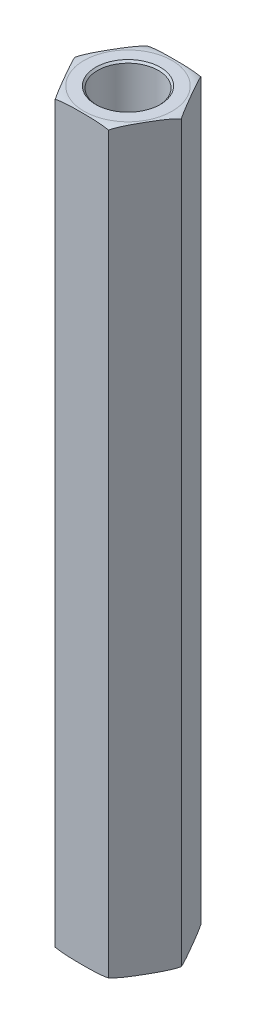
ISO-10303-21;
HEADER;
FILE_DESCRIPTION(('STEP AP214'),'2;1');
FILE_NAME('part.step','',(''),(''),'','','');
FILE_SCHEMA(('AUTOMOTIVE_DESIGN { 1 0 10303 214 1 1 1 1 }'));
ENDSEC;
DATA;
#1=APPLICATION_CONTEXT('core data for automotive mechanical design processes');
#2=APPLICATION_PROTOCOL_DEFINITION('international standard','automotive_design',2000,#1);
#3=PRODUCT_CONTEXT('',#1,'mechanical');
#4=PRODUCT('Part','Part','',(#3));
#5=PRODUCT_RELATED_PRODUCT_CATEGORY('part','',(#4));
#6=PRODUCT_DEFINITION_FORMATION('','',#4);
#7=PRODUCT_DEFINITION_CONTEXT('part definition',#1,'design');
#8=PRODUCT_DEFINITION('design','',#6,#7);
#9=PRODUCT_DEFINITION_SHAPE('','',#8);
#10=(LENGTH_UNIT() NAMED_UNIT(*) SI_UNIT(.MILLI.,.METRE.));
#11=(NAMED_UNIT(*) PLANE_ANGLE_UNIT() SI_UNIT($,.RADIAN.));
#12=(NAMED_UNIT(*) SI_UNIT($,.STERADIAN.) SOLID_ANGLE_UNIT());
#13=UNCERTAINTY_MEASURE_WITH_UNIT(LENGTH_MEASURE(1.E-05),#10,'distance_accuracy_value','');
#14=(GEOMETRIC_REPRESENTATION_CONTEXT(3) GLOBAL_UNCERTAINTY_ASSIGNED_CONTEXT((#13)) GLOBAL_UNIT_ASSIGNED_CONTEXT((#10,
#11,#12)) REPRESENTATION_CONTEXT('',''));
#15=CARTESIAN_POINT('',(0.,0.,0.));
#16=DIRECTION('',(0.,0.,1.));
#17=DIRECTION('',(1.,0.,0.));
#18=AXIS2_PLACEMENT_3D('',#15,#16,#17);
#19=CARTESIAN_POINT('',(0.,12.7,0.));
#20=DIRECTION('',(0.,1.,0.));
#21=DIRECTION('',(0.,0.,1.));
#22=AXIS2_PLACEMENT_3D('',#19,#20,#21);
#23=PLANE('',#22);
#24=CARTESIAN_POINT('',(0.,12.7,0.));
#25=DIRECTION('',(0.,1.,0.));
#26=DIRECTION('',(0.,0.,1.));
#27=AXIS2_PLACEMENT_3D('',#24,#25,#26);
#28=CIRCLE('',#27,2.0955);
#29=CARTESIAN_POINT('',(0.,12.7,2.0955));
#30=VERTEX_POINT('',#29);
#31=EDGE_CURVE('E363',#30,#30,#28,.T.);
#32=ORIENTED_EDGE('',*,*,#31,.T.);
#33=EDGE_LOOP('',(#32));
#34=FACE_BOUND('',#33,.T.);
#35=ADVANCED_FACE('F14',(#34),#23,.T.);
#36=CARTESIAN_POINT('',(0.,-12.7,0.));
#37=DIRECTION('',(0.,-1.,0.));
#38=DIRECTION('',(0.,0.,-1.));
#39=AXIS2_PLACEMENT_3D('',#36,#37,#38);
#40=PLANE('',#39);
#41=CARTESIAN_POINT('',(0.,-12.7,0.));
#42=DIRECTION('',(0.,-1.,0.));
#43=DIRECTION('',(0.,0.,-1.));
#44=AXIS2_PLACEMENT_3D('',#41,#42,#43);
#45=CIRCLE('',#44,2.0955);
#46=CARTESIAN_POINT('',(0.,-12.7,-2.0955));
#47=VERTEX_POINT('',#46);
#48=EDGE_CURVE('E365',#47,#47,#45,.T.);
#49=ORIENTED_EDGE('',*,*,#48,.T.);
#50=EDGE_LOOP('',(#49));
#51=FACE_BOUND('',#50,.T.);
#52=ADVANCED_FACE('F342',(#51),#40,.T.);
#53=CARTESIAN_POINT('',(0.,12.7,0.));
#54=DIRECTION('',(0.,1.,0.));
#55=DIRECTION('',(0.,0.,1.));
#56=AXIS2_PLACEMENT_3D('',#53,#54,#55);
#57=CYLINDRICAL_SURFACE('',#56,2.0955);
#58=CARTESIAN_POINT('',(0.,25.2729999999701,0.));
#59=DIRECTION('',(0.,1.,0.));
#60=DIRECTION('',(0.,0.,1.));
#61=AXIS2_PLACEMENT_3D('',#58,#59,#60);
#62=CIRCLE('',#61,2.09549999993897);
#63=CARTESIAN_POINT('',(0.,25.2729999999701,2.09549999993897));
#64=VERTEX_POINT('',#63);
#65=EDGE_CURVE('E368',#64,#64,#62,.T.);
#66=ORIENTED_EDGE('',*,*,#65,.T.);
#67=EDGE_LOOP('',(#66));
#68=FACE_BOUND('',#67,.T.);
#69=ORIENTED_EDGE('',*,*,#31,.F.);
#70=EDGE_LOOP('',(#69));
#71=FACE_BOUND('',#70,.T.);
#72=ADVANCED_FACE('F334',(#68,#71),#57,.F.);
#73=CARTESIAN_POINT('',(0.,-12.7,0.));
#74=DIRECTION('',(0.,-1.,0.));
#75=DIRECTION('',(0.,0.,-1.));
#76=AXIS2_PLACEMENT_3D('',#73,#74,#75);
#77=CYLINDRICAL_SURFACE('',#76,2.0955);
#78=ORIENTED_EDGE('',*,*,#48,.F.);
#79=EDGE_LOOP('',(#78));
#80=FACE_BOUND('',#79,.T.);
#81=CARTESIAN_POINT('',(0.,-25.2729999999701,0.));
#82=DIRECTION('',(0.,-1.,0.));
#83=DIRECTION('',(0.,0.,-1.));
#84=AXIS2_PLACEMENT_3D('',#81,#82,#83);
#85=CIRCLE('',#84,2.09549999999581);
#86=CARTESIAN_POINT('',(0.,-25.2729999999701,-2.09549999999581));
#87=VERTEX_POINT('',#86);
#88=EDGE_CURVE('E398',#87,#87,#85,.T.);
#89=ORIENTED_EDGE('',*,*,#88,.T.);
#90=EDGE_LOOP('',(#89));
#91=FACE_BOUND('',#90,.T.);
#92=ADVANCED_FACE('F326',(#80,#91),#77,.F.);
#93=CARTESIAN_POINT('',(0.,25.3999999998769,0.));
#94=DIRECTION('',(0.,1.,0.));
#95=DIRECTION('',(-1.,0.,0.));
#96=AXIS2_PLACEMENT_3D('',#93,#94,#95);
#97=CONICAL_SURFACE('',#96,2.2224999998457,0.785398163397448);
#98=CARTESIAN_POINT('',(0.,25.3999999999905,0.));
#99=DIRECTION('',(0.,1.,0.));
#100=DIRECTION('',(-1.,0.,0.));
#101=AXIS2_PLACEMENT_3D('',#98,#99,#100);
#102=CIRCLE('',#101,2.22249999995938);
#103=CARTESIAN_POINT('',(-2.22249999995938,25.3999999999905,0.));
#104=VERTEX_POINT('',#103);
#105=EDGE_CURVE('E78',#104,#104,#102,.T.);
#106=ORIENTED_EDGE('',*,*,#105,.T.);
#107=EDGE_LOOP('',(#106));
#108=FACE_BOUND('',#107,.T.);
#109=ORIENTED_EDGE('',*,*,#65,.F.);
#110=EDGE_LOOP('',(#109));
#111=FACE_BOUND('',#110,.T.);
#112=ADVANCED_FACE('F320',(#108,#111),#97,.F.);
#113=CARTESIAN_POINT('',(-3.66617420935413,25.4,0.));
#114=DIRECTION('',(0.866025403784439,0.,-0.499999999999999));
#115=DIRECTION('',(-0.499999999999999,0.,-0.866025403784439));
#116=AXIS2_PLACEMENT_3D('',#113,#114,#115);
#117=PLANE('',#116);
#118=DIRECTION('',(0.,1.,0.));
#119=VECTOR('',#118,1.);
#120=CARTESIAN_POINT('',(-1.83308710467708,25.4,3.175));
#121=LINE('',#120,#119);
#122=CARTESIAN_POINT('',(-1.83308710467707,-25.273,3.17499999999999));
#123=VERTEX_POINT('',#122);
#124=CARTESIAN_POINT('',(-1.83308710467706,25.273,3.175));
#125=VERTEX_POINT('',#124);
#126=EDGE_CURVE('E74',#123,#125,#121,.T.);
#127=ORIENTED_EDGE('',*,*,#126,.T.);
#128=CARTESIAN_POINT('',(-3.66617420935412,25.273,0.));
#129=CARTESIAN_POINT('',(-3.62797961467395,25.2889014148997,0.0661549785605581));
#130=CARTESIAN_POINT('',(-3.58956810864158,25.3024886076105,0.132685658603871));
#131=CARTESIAN_POINT('',(-3.51249051795712,25.3258161979402,0.266187961794345));
#132=CARTESIAN_POINT('',(-3.47382473049848,25.3355604771397,0.333159070187372));
#133=CARTESIAN_POINT('',(-3.39641631867875,25.3519966530451,0.467234372392355));
#134=CARTESIAN_POINT('',(-3.35767399633315,25.3586945328669,0.534338043098154));
#135=CARTESIAN_POINT('',(-3.28009834620116,25.3697767572932,0.668703010556943));
#136=CARTESIAN_POINT('',(-3.24126499587774,25.374160450474,0.735964346345226));
#137=CARTESIAN_POINT('',(-3.16354065964318,25.3812403004263,0.870586845688048));
#138=CARTESIAN_POINT('',(-3.1246496537448,25.3839355237591,0.937948043861515));
#139=CARTESIAN_POINT('',(-3.04685144594597,25.3881531983713,1.07269849250688));
#140=CARTESIAN_POINT('',(-3.00794424351974,25.3896756080272,1.14008774388949));
#141=CARTESIAN_POINT('',(-2.93051517598878,25.391922705889,1.27419882283578));
#142=CARTESIAN_POINT('',(-2.8919933624894,25.3926552468181,1.34092056101641));
#143=CARTESIAN_POINT('',(-2.81494778346149,25.3935767302574,1.4743674183913));
#144=CARTESIAN_POINT('',(-2.77642401791445,25.3937656658949,1.54109253761765));
#145=CARTESIAN_POINT('',(-2.69935964431019,25.3936659966806,1.67457194815371));
#146=CARTESIAN_POINT('',(-2.66081903631828,25.3933771811766,1.74132623935029));
#147=CARTESIAN_POINT('',(-2.58373908085337,25.392221986219,1.87483263846066));
#148=CARTESIAN_POINT('',(-2.54519973341253,25.3913555970386,1.94158474631875));
#149=CARTESIAN_POINT('',(-2.46812969629779,25.3887861940656,2.0750739663427));
#150=CARTESIAN_POINT('',(-2.42959900625973,25.3870832271617,2.1418110791393));
#151=CARTESIAN_POINT('',(-2.35255651340917,25.3824387229726,2.27525259109823));
#152=CARTESIAN_POINT('',(-2.31404470975451,25.3794972471358,2.34195699171921));
#153=CARTESIAN_POINT('',(-2.25084206239953,25.3732174124749,2.4514271881109));
#154=CARTESIAN_POINT('',(-2.22613849337018,25.3703980110463,2.49421502479802));
#155=CARTESIAN_POINT('',(-2.17676945272235,25.3638696794304,2.579724711521));
#156=CARTESIAN_POINT('',(-2.1521039703419,25.3601610809139,2.62244658019713));
#157=CARTESIAN_POINT('',(-2.10282753811702,25.3516802711497,2.70779586442636));
#158=CARTESIAN_POINT('',(-2.07821657107534,25.3469084657009,2.75042330976594));
#159=CARTESIAN_POINT('',(-2.02900094683554,25.3360987712516,2.83566727147549));
#160=CARTESIAN_POINT('',(-2.00439646085467,25.3300577313084,2.87828349128847));
#161=CARTESIAN_POINT('',(-1.95527325900936,25.3165138354161,2.96336737271501));
#162=CARTESIAN_POINT('',(-1.93075459617617,25.309010197803,3.00583494247576));
#163=CARTESIAN_POINT('',(-1.88182157373173,25.2923203507084,3.09058942351743));
#164=CARTESIAN_POINT('',(-1.85740744053271,25.2831314978033,3.13287594264089));
#165=CARTESIAN_POINT('',(-1.83308710467707,25.273,3.175));
#166=B_SPLINE_CURVE_WITH_KNOTS('',3,(#128,#129,#130,#131,#132,#133,#134,#135,#136,#137,#138,
#139,#140,#141,#142,#143,#144,#145,#146,#147,#148,#149,#150,#151,#152,#153,#154,#155,#156,#157,
#158,#159,#160,#161,#162,#163,#164,#165),.UNSPECIFIED.,.F.,.F.,(4,2,2,2,2,2,2,2,2,2,2,2,2,2,2,2,
2,2,4),(0.,0.233977307817926,0.467717675040663,0.700996973557454,0.934341903229689,
1.16781571967232,1.40129782179815,1.63243665809659,1.86357841666605,2.09482211846281,
2.3260697147148,2.55730435147381,2.78852751694395,2.93698369265072,3.08538458004461,
3.23372892334575,3.38244598546606,3.5312427462608,3.68027493713584),.UNSPECIFIED.);
#167=CARTESIAN_POINT('',(-3.66617420935412,25.273,0.));
#168=VERTEX_POINT('',#167);
#169=EDGE_CURVE('E67',#168,#125,#166,.T.);
#170=ORIENTED_EDGE('',*,*,#169,.F.);
#171=DIRECTION('',(0.,1.,0.));
#172=VECTOR('',#171,1.);
#173=CARTESIAN_POINT('',(-3.66617420935413,25.4,0.));
#174=LINE('',#173,#172);
#175=CARTESIAN_POINT('',(-3.66617420935413,-25.273,0.));
#176=VERTEX_POINT('',#175);
#177=EDGE_CURVE('E71',#168,#176,#174,.F.);
#178=ORIENTED_EDGE('',*,*,#177,.T.);
#179=CARTESIAN_POINT('',(-1.83308710467707,-25.273,3.17499999999999));
#180=CARTESIAN_POINT('',(-1.87128169935724,-25.2889014148997,3.10884502143943));
#181=CARTESIAN_POINT('',(-1.90969320538962,-25.3024886076105,3.04231434139612));
#182=CARTESIAN_POINT('',(-1.98677079607408,-25.3258161979402,2.90881203820565));
#183=CARTESIAN_POINT('',(-2.02543658353272,-25.3355604771397,2.84184092981262));
#184=CARTESIAN_POINT('',(-2.10284499535244,-25.3519966530451,2.70776562760764));
#185=CARTESIAN_POINT('',(-2.14158731769805,-25.3586945328669,2.64066195690184));
#186=CARTESIAN_POINT('',(-2.21916296783004,-25.3697767572932,2.50629698944305));
#187=CARTESIAN_POINT('',(-2.25799631815346,-25.374160450474,2.43903565365477));
#188=CARTESIAN_POINT('',(-2.33572065438801,-25.3812403004263,2.30441315431194));
#189=CARTESIAN_POINT('',(-2.3746116602864,-25.3839355237591,2.23705195613848));
#190=CARTESIAN_POINT('',(-2.45240986808522,-25.3881531983713,2.10230150749311));
#191=CARTESIAN_POINT('',(-2.49131707051146,-25.3896756080272,2.03491225611051));
#192=CARTESIAN_POINT('',(-2.56874613804241,-25.391922705889,1.90080117716421));
#193=CARTESIAN_POINT('',(-2.6072679515418,-25.3926552468181,1.83407943898358));
#194=CARTESIAN_POINT('',(-2.6843135305697,-25.3935767302574,1.70063258160869));
#195=CARTESIAN_POINT('',(-2.72283729611674,-25.3937656658949,1.63390746238234));
#196=CARTESIAN_POINT('',(-2.79990166972101,-25.3936659966806,1.50042805184629));
#197=CARTESIAN_POINT('',(-2.83844227771292,-25.3933771811766,1.43367376064971));
#198=CARTESIAN_POINT('',(-2.91552223317783,-25.392221986219,1.30016736153933));
#199=CARTESIAN_POINT('',(-2.95406158061867,-25.3913555970386,1.23341525368124));
#200=CARTESIAN_POINT('',(-3.03113161773341,-25.3887861940656,1.09992603365729));
#201=CARTESIAN_POINT('',(-3.06966230777146,-25.3870832271617,1.0331889208607));
#202=CARTESIAN_POINT('',(-3.14670480062202,-25.3824387229726,0.89974740890176));
#203=CARTESIAN_POINT('',(-3.18521660427668,-25.3794972471358,0.833043008280778));
#204=CARTESIAN_POINT('',(-3.24841925163166,-25.3732174124749,0.723572811889091));
#205=CARTESIAN_POINT('',(-3.27312282066101,-25.3703980110463,0.680784975201969));
#206=CARTESIAN_POINT('',(-3.32249186130885,-25.3638696794304,0.595275288478994));
#207=CARTESIAN_POINT('',(-3.34715734368929,-25.3601610809139,0.552553419802862));
#208=CARTESIAN_POINT('',(-3.39643377591418,-25.3516802711497,0.467204135573638));
#209=CARTESIAN_POINT('',(-3.42104474295585,-25.3469084657009,0.424576690234055));
#210=CARTESIAN_POINT('',(-3.47026036719565,-25.3360987712516,0.3393327285245));
#211=CARTESIAN_POINT('',(-3.49486485317652,-25.3300577313084,0.296716508711521));
#212=CARTESIAN_POINT('',(-3.54398805502183,-25.3165138354161,0.211632627284985));
#213=CARTESIAN_POINT('',(-3.56850671785503,-25.309010197803,0.169165057524237));
#214=CARTESIAN_POINT('',(-3.61743974029946,-25.2923203507084,0.0844105764825623));
#215=CARTESIAN_POINT('',(-3.64185387349848,-25.2831314978033,0.0421240573591059));
#216=CARTESIAN_POINT('',(-3.66617420935413,-25.273,0.));
#217=B_SPLINE_CURVE_WITH_KNOTS('',3,(#179,#180,#181,#182,#183,#184,#185,#186,#187,#188,#189,
#190,#191,#192,#193,#194,#195,#196,#197,#198,#199,#200,#201,#202,#203,#204,#205,#206,#207,#208,
#209,#210,#211,#212,#213,#214,#215,#216),.UNSPECIFIED.,.F.,.F.,(4,2,2,2,2,2,2,2,2,2,2,2,2,2,2,2,
2,2,4),(0.,0.233977307817926,0.467717675040664,0.700996973557455,0.934341903229689,
1.16781571967232,1.40129782179815,1.63243665809659,1.86357841666605,2.09482211846281,
2.3260697147148,2.55730435147381,2.78852751694395,2.93698369265072,3.08538458004461,
3.23372892334575,3.38244598546606,3.5312427462608,3.68027493713584),.UNSPECIFIED.);
#218=EDGE_CURVE('E86',#123,#176,#217,.T.);
#219=ORIENTED_EDGE('',*,*,#218,.F.);
#220=EDGE_LOOP('',(#127,#170,#178,#219));
#221=FACE_BOUND('',#220,.T.);
#222=ADVANCED_FACE('F69',(#221),#117,.F.);
#223=CARTESIAN_POINT('',(0.,-25.3999999998769,0.));
#224=DIRECTION('',(0.,-1.,0.));
#225=DIRECTION('',(1.,0.,0.));
#226=AXIS2_PLACEMENT_3D('',#223,#224,#225);
#227=CONICAL_SURFACE('',#226,2.22249999990254,0.785398163173655);
#228=ORIENTED_EDGE('',*,*,#88,.F.);
#229=EDGE_LOOP('',(#228));
#230=FACE_BOUND('',#229,.T.);
#231=CARTESIAN_POINT('',(0.,-25.3999999999337,0.));
#232=DIRECTION('',(0.,-1.,0.));
#233=DIRECTION('',(1.,0.,0.));
#234=AXIS2_PLACEMENT_3D('',#231,#232,#233);
#235=CIRCLE('',#234,2.22249999995938);
#236=CARTESIAN_POINT('',(2.22249999995938,-25.3999999999337,0.));
#237=VERTEX_POINT('',#236);
#238=EDGE_CURVE('E139',#237,#237,#235,.F.);
#239=ORIENTED_EDGE('',*,*,#238,.F.);
#240=EDGE_LOOP('',(#239));
#241=FACE_BOUND('',#240,.T.);
#242=ADVANCED_FACE('F307',(#230,#241),#227,.F.);
#243=CARTESIAN_POINT('',(-1.83308710467707,25.4,-3.175));
#244=DIRECTION('',(0.,-1.,0.));
#245=DIRECTION('',(0.,0.,-1.));
#246=AXIS2_PLACEMENT_3D('',#243,#244,#245);
#247=PLANE('',#246);
#248=CARTESIAN_POINT('',(0.,25.4,0.));
#249=DIRECTION('',(0.,-1.,0.));
#250=DIRECTION('',(0.,0.,1.));
#251=AXIS2_PLACEMENT_3D('',#248,#249,#250);
#252=CIRCLE('',#251,3.03117420935412);
#253=CARTESIAN_POINT('',(0.,25.4,3.03117420935412));
#254=VERTEX_POINT('',#253);
#255=CARTESIAN_POINT('',(0.,25.4,-3.03117420935412));
#256=VERTEX_POINT('',#255);
#257=EDGE_CURVE('E77',#254,#256,#252,.T.);
#258=ORIENTED_EDGE('',*,*,#257,.F.);
#259=CARTESIAN_POINT('',(0.,25.4,0.));
#260=DIRECTION('',(0.,-1.,0.));
#261=DIRECTION('',(0.,0.,-1.));
#262=AXIS2_PLACEMENT_3D('',#259,#260,#261);
#263=CIRCLE('',#262,3.03117420935412);
#264=EDGE_CURVE('E150',#256,#254,#263,.T.);
#265=ORIENTED_EDGE('',*,*,#264,.F.);
#266=EDGE_LOOP('',(#258,#265));
#267=FACE_BOUND('',#266,.T.);
#268=ORIENTED_EDGE('',*,*,#105,.F.);
#269=EDGE_LOOP('',(#268));
#270=FACE_BOUND('',#269,.T.);
#271=ADVANCED_FACE('F114',(#267,#270),#247,.F.);
#272=CARTESIAN_POINT('',(-1.83308710467707,25.4,-3.175));
#273=DIRECTION('',(0.866025403784439,0.,0.5));
#274=DIRECTION('',(0.5,0.,-0.866025403784439));
#275=AXIS2_PLACEMENT_3D('',#272,#273,#274);
#276=PLANE('',#275);
#277=ORIENTED_EDGE('',*,*,#177,.F.);
#278=CARTESIAN_POINT('',(-1.83308710467706,25.273,-3.17500000000001));
#279=CARTESIAN_POINT('',(-1.87128169935723,25.2889014148997,-3.10884502143946));
#280=CARTESIAN_POINT('',(-1.90969320538961,25.3024886076105,-3.04231434139615));
#281=CARTESIAN_POINT('',(-1.98677079607406,25.3258161979402,-2.90881203820568));
#282=CARTESIAN_POINT('',(-2.0254365835327,25.3355604771397,-2.84184092981265));
#283=CARTESIAN_POINT('',(-2.10284499535242,25.3519966530451,-2.70776562760767));
#284=CARTESIAN_POINT('',(-2.14158731769803,25.3586945328669,-2.64066195690188));
#285=CARTESIAN_POINT('',(-2.21916296783001,25.3697767572932,-2.50629698944309));
#286=CARTESIAN_POINT('',(-2.25799631815343,25.374160450474,-2.43903565365481));
#287=CARTESIAN_POINT('',(-2.33572065438799,25.3812403004263,-2.30441315431199));
#288=CARTESIAN_POINT('',(-2.37461166028637,25.3839355237591,-2.23705195613853));
#289=CARTESIAN_POINT('',(-2.4524098680852,25.3881531983713,-2.10230150749316));
#290=CARTESIAN_POINT('',(-2.49131707051143,25.3896756080272,-2.03491225611056));
#291=CARTESIAN_POINT('',(-2.56874613804238,25.391922705889,-1.90080117716427));
#292=CARTESIAN_POINT('',(-2.60726795154177,25.3926552468181,-1.83407943898364));
#293=CARTESIAN_POINT('',(-2.68431353056967,25.3935767302574,-1.70063258160875));
#294=CARTESIAN_POINT('',(-2.72283729611671,25.3937656658949,-1.63390746238241));
#295=CARTESIAN_POINT('',(-2.79990166972097,25.3936659966806,-1.50042805184636));
#296=CARTESIAN_POINT('',(-2.83844227771288,25.3933771811766,-1.43367376064978));
#297=CARTESIAN_POINT('',(-2.91552223317779,25.392221986219,-1.30016736153941));
#298=CARTESIAN_POINT('',(-2.95406158061863,25.3913555970386,-1.23341525368132));
#299=CARTESIAN_POINT('',(-3.03113161773336,25.3887861940656,-1.09992603365738));
#300=CARTESIAN_POINT('',(-3.06966230777142,25.3870832271617,-1.03318892086078));
#301=CARTESIAN_POINT('',(-3.14670480062198,25.3824387229726,-0.899747408901851));
#302=CARTESIAN_POINT('',(-3.18521660427663,25.3794972471358,-0.833043008280872));
#303=CARTESIAN_POINT('',(-3.24841925163162,25.3732174124749,-0.723572811889181));
#304=CARTESIAN_POINT('',(-3.27312282066097,25.3703980110463,-0.680784975202054));
#305=CARTESIAN_POINT('',(-3.32249186130881,25.3638696794304,-0.595275288479069));
#306=CARTESIAN_POINT('',(-3.34715734368926,25.3601610809139,-0.552553419802932));
#307=CARTESIAN_POINT('',(-3.39643377591415,25.3516802711497,-0.467204135573698));
#308=CARTESIAN_POINT('',(-3.42104474295583,25.3469084657009,-0.42457669023411));
#309=CARTESIAN_POINT('',(-3.47026036719563,25.3360987712516,-0.339332728524545));
#310=CARTESIAN_POINT('',(-3.4948648531765,25.3300577313084,-0.296716508711561));
#311=CARTESIAN_POINT('',(-3.54398805502182,25.3165138354161,-0.211632627285015));
#312=CARTESIAN_POINT('',(-3.56850671785502,25.309010197803,-0.169165057524262));
#313=CARTESIAN_POINT('',(-3.61743974029946,25.2923203507084,-0.0844105764825772));
#314=CARTESIAN_POINT('',(-3.64185387349848,25.2831314978033,-0.0421240573591158));
#315=CARTESIAN_POINT('',(-3.66617420935413,25.273,0.));
#316=B_SPLINE_CURVE_WITH_KNOTS('',3,(#278,#279,#280,#281,#282,#283,#284,#285,#286,#287,#288,
#289,#290,#291,#292,#293,#294,#295,#296,#297,#298,#299,#300,#301,#302,#303,#304,#305,#306,#307,
#308,#309,#310,#311,#312,#313,#314,#315),.UNSPECIFIED.,.F.,.F.,(4,2,2,2,2,2,2,2,2,2,2,2,2,2,2,2,
2,2,4),(0.,0.23397730781792,0.46771767504065,0.700996973557434,0.934341903229662,
1.16781571967229,1.40129782179811,1.63243665809654,1.86357841666599,2.09482211846275,
2.32606971471473,2.55730435147374,2.78852751694387,2.93698369265066,3.08538458004457,
3.23372892334572,3.38244598546605,3.53124274626081,3.68027493713586),.UNSPECIFIED.);
#317=CARTESIAN_POINT('',(-1.83308710467705,25.273,-3.17500000000001));
#318=VERTEX_POINT('',#317);
#319=EDGE_CURVE('E83',#318,#168,#316,.T.);
#320=ORIENTED_EDGE('',*,*,#319,.F.);
#321=DIRECTION('',(0.,1.,0.));
#322=VECTOR('',#321,1.);
#323=CARTESIAN_POINT('',(-1.83308710467704,25.4,-3.175));
#324=LINE('',#323,#322);
#325=CARTESIAN_POINT('',(-1.83308710467707,-25.273,-3.175));
#326=VERTEX_POINT('',#325);
#327=EDGE_CURVE('E172',#318,#326,#324,.F.);
#328=ORIENTED_EDGE('',*,*,#327,.T.);
#329=CARTESIAN_POINT('',(-3.66617420935413,-25.273,0.));
#330=CARTESIAN_POINT('',(-3.62797961467396,-25.2889014148997,-0.0661549785605592));
#331=CARTESIAN_POINT('',(-3.58956810864158,-25.3024886076105,-0.132685658603871));
#332=CARTESIAN_POINT('',(-3.51249051795713,-25.3258161979402,-0.266187961794345));
#333=CARTESIAN_POINT('',(-3.47382473049848,-25.3355604771397,-0.333159070187371));
#334=CARTESIAN_POINT('',(-3.39641631867876,-25.3519966530451,-0.467234372392353));
#335=CARTESIAN_POINT('',(-3.35767399633315,-25.3586945328669,-0.534338043098151));
#336=CARTESIAN_POINT('',(-3.28009834620117,-25.3697767572932,-0.668703010556939));
#337=CARTESIAN_POINT('',(-3.24126499587775,-25.374160450474,-0.735964346345221));
#338=CARTESIAN_POINT('',(-3.16354065964319,-25.3812403004263,-0.870586845688041));
#339=CARTESIAN_POINT('',(-3.1246496537448,-25.3839355237591,-0.937948043861508));
#340=CARTESIAN_POINT('',(-3.04685144594598,-25.3881531983713,-1.07269849250687));
#341=CARTESIAN_POINT('',(-3.00794424351975,-25.3896756080272,-1.14008774388948));
#342=CARTESIAN_POINT('',(-2.93051517598879,-25.391922705889,-1.27419882283577));
#343=CARTESIAN_POINT('',(-2.89199336248941,-25.3926552468181,-1.3409205610164));
#344=CARTESIAN_POINT('',(-2.8149477834615,-25.3935767302574,-1.47436741839129));
#345=CARTESIAN_POINT('',(-2.77642401791446,-25.3937656658949,-1.54109253761764));
#346=CARTESIAN_POINT('',(-2.6993596443102,-25.3936659966806,-1.67457194815369));
#347=CARTESIAN_POINT('',(-2.66081903631829,-25.3933771811766,-1.74132623935027));
#348=CARTESIAN_POINT('',(-2.58373908085338,-25.392221986219,-1.87483263846065));
#349=CARTESIAN_POINT('',(-2.54519973341254,-25.3913555970386,-1.94158474631873));
#350=CARTESIAN_POINT('',(-2.4681296962978,-25.3887861940656,-2.07507396634268));
#351=CARTESIAN_POINT('',(-2.42959900625974,-25.3870832271617,-2.14181107913928));
#352=CARTESIAN_POINT('',(-2.35255651340918,-25.3824387229726,-2.27525259109821));
#353=CARTESIAN_POINT('',(-2.31404470975453,-25.3794972471358,-2.34195699171919));
#354=CARTESIAN_POINT('',(-2.25084206239954,-25.3732174124749,-2.45142718811088));
#355=CARTESIAN_POINT('',(-2.22613849337019,-25.3703980110463,-2.494215024798));
#356=CARTESIAN_POINT('',(-2.17676945272236,-25.3638696794304,-2.57972471152098));
#357=CARTESIAN_POINT('',(-2.15210397034191,-25.3601610809139,-2.62244658019711));
#358=CARTESIAN_POINT('',(-2.10282753811703,-25.3516802711497,-2.70779586442634));
#359=CARTESIAN_POINT('',(-2.07821657107535,-25.3469084657009,-2.75042330976592));
#360=CARTESIAN_POINT('',(-2.02900094683555,-25.3360987712516,-2.83566727147548));
#361=CARTESIAN_POINT('',(-2.00439646085468,-25.3300577313084,-2.87828349128846));
#362=CARTESIAN_POINT('',(-1.95527325900937,-25.3165138354161,-2.963367372715));
#363=CARTESIAN_POINT('',(-1.93075459617617,-25.309010197803,-3.00583494247575));
#364=CARTESIAN_POINT('',(-1.88182157373174,-25.2923203507084,-3.09058942351742));
#365=CARTESIAN_POINT('',(-1.85740744053272,-25.2831314978033,-3.13287594264088));
#366=CARTESIAN_POINT('',(-1.83308710467707,-25.273,-3.17499999999999));
#367=B_SPLINE_CURVE_WITH_KNOTS('',3,(#329,#330,#331,#332,#333,#334,#335,#336,#337,#338,#339,
#340,#341,#342,#343,#344,#345,#346,#347,#348,#349,#350,#351,#352,#353,#354,#355,#356,#357,#358,
#359,#360,#361,#362,#363,#364,#365,#366),.UNSPECIFIED.,.F.,.F.,(4,2,2,2,2,2,2,2,2,2,2,2,2,2,2,2,
2,2,4),(0.,0.233977307817924,0.46771767504066,0.700996973557448,0.934341903229681,
1.16781571967231,1.40129782179814,1.63243665809658,1.86357841666603,2.09482211846279,
2.32606971471478,2.55730435147379,2.78852751694393,2.9369836926507,3.08538458004459,
3.23372892334574,3.38244598546605,3.53124274626079,3.68027493713583),.UNSPECIFIED.);
#368=EDGE_CURVE('E85',#176,#326,#367,.T.);
#369=ORIENTED_EDGE('',*,*,#368,.F.);
#370=EDGE_LOOP('',(#277,#320,#328,#369));
#371=FACE_BOUND('',#370,.T.);
#372=ADVANCED_FACE('F81',(#371),#276,.F.);
#373=CARTESIAN_POINT('',(-1.83308710467707,25.4,3.175));
#374=DIRECTION('',(0.,0.,-1.));
#375=DIRECTION('',(-1.,0.,0.));
#376=AXIS2_PLACEMENT_3D('',#373,#374,#375);
#377=PLANE('',#376);
#378=DIRECTION('',(0.,1.,0.));
#379=VECTOR('',#378,1.);
#380=CARTESIAN_POINT('',(1.83308710467706,25.4,3.17499999999999));
#381=LINE('',#380,#379);
#382=CARTESIAN_POINT('',(1.83308710467706,-25.273,3.17499999999999));
#383=VERTEX_POINT('',#382);
#384=CARTESIAN_POINT('',(1.83308710467706,25.273,3.17499999999999));
#385=VERTEX_POINT('',#384);
#386=EDGE_CURVE('E170',#383,#385,#381,.T.);
#387=ORIENTED_EDGE('',*,*,#386,.T.);
#388=CARTESIAN_POINT('',(-1.83308710467706,25.273,3.175));
#389=CARTESIAN_POINT('',(-1.73237579828683,25.2939400141518,3.175));
#390=CARTESIAN_POINT('',(-1.63096506893486,25.3108853495327,3.175));
#391=CARTESIAN_POINT('',(-1.42767146651469,25.3384971643984,3.175));
#392=CARTESIAN_POINT('',(-1.32579191427254,25.3491875658753,3.175));
#393=CARTESIAN_POINT('',(-1.12177634709138,25.3661280408079,3.175));
#394=CARTESIAN_POINT('',(-1.0196405664338,25.3723812707189,3.175));
#395=CARTESIAN_POINT('',(-0.815663681397376,25.3819028064183,3.175));
#396=CARTESIAN_POINT('',(-0.713823115514574,25.3851834044999,3.175));
#397=CARTESIAN_POINT('',(-0.510018485441651,25.3899454848703,3.175));
#398=CARTESIAN_POINT('',(-0.408054390577977,25.3914254100882,3.175));
#399=CARTESIAN_POINT('',(-0.204060200337871,25.3933146818379,3.175));
#400=CARTESIAN_POINT('',(-0.102030100168935,25.3937234241492,3.175));
#401=CARTESIAN_POINT('',(0.102030100168936,25.3937234241492,3.175));
#402=CARTESIAN_POINT('',(0.204060200337871,25.3933146818379,3.175));
#403=CARTESIAN_POINT('',(0.408054390577978,25.3914254100882,3.17499999999999));
#404=CARTESIAN_POINT('',(0.510018485441653,25.3899454848703,3.17499999999999));
#405=CARTESIAN_POINT('',(0.713823115514575,25.3851834044999,3.17499999999999));
#406=CARTESIAN_POINT('',(0.815663681397378,25.3819028064183,3.17499999999999));
#407=CARTESIAN_POINT('',(1.0196405664338,25.3723812707189,3.17499999999999));
#408=CARTESIAN_POINT('',(1.12177634709138,25.3661280408079,3.17499999999999));
#409=CARTESIAN_POINT('',(1.32579191427254,25.3491875658753,3.17499999999999));
#410=CARTESIAN_POINT('',(1.42767146651469,25.3384971643984,3.17499999999999));
#411=CARTESIAN_POINT('',(1.63096506893486,25.3108853495327,3.17499999999999));
#412=CARTESIAN_POINT('',(1.73237579828684,25.2939400141518,3.17499999999999));
#413=CARTESIAN_POINT('',(1.83308710467706,25.273,3.17499999999999));
#414=B_SPLINE_CURVE_WITH_KNOTS('',3,(#388,#389,#390,#391,#392,#393,#394,#395,#396,#397,#398,
#399,#400,#401,#402,#403,#404,#405,#406,#407,#408,#409,#410,#411,#412,#413),.UNSPECIFIED.,.F.,
.F.,(4,2,2,2,2,2,2,2,2,2,2,2,4),(0.,0.308333242342808,0.615479423308236,0.92240689113001,
1.2280592962085,1.53397581645216,1.84006485747889,2.14615389850562,2.45207041874928,
2.75772282382777,3.06465029164954,3.37179647261497,3.68012971495778),.UNSPECIFIED.);
#415=EDGE_CURVE('E143',#125,#385,#414,.T.);
#416=ORIENTED_EDGE('',*,*,#415,.F.);
#417=ORIENTED_EDGE('',*,*,#126,.F.);
#418=CARTESIAN_POINT('',(1.83308710467706,-25.273,3.17499999999999));
#419=CARTESIAN_POINT('',(1.73237579828684,-25.2939400141518,3.17499999999999));
#420=CARTESIAN_POINT('',(1.63096506893486,-25.3108853495327,3.17499999999999));
#421=CARTESIAN_POINT('',(1.4276714665147,-25.3384971643984,3.17499999999999));
#422=CARTESIAN_POINT('',(1.32579191427254,-25.3491875658753,3.17499999999999));
#423=CARTESIAN_POINT('',(1.12177634709138,-25.3661280408079,3.17499999999999));
#424=CARTESIAN_POINT('',(1.0196405664338,-25.3723812707189,3.17499999999999));
#425=CARTESIAN_POINT('',(0.815663681397379,-25.3819028064183,3.17499999999999));
#426=CARTESIAN_POINT('',(0.713823115514576,-25.3851834044999,3.17499999999999));
#427=CARTESIAN_POINT('',(0.510018485441653,-25.3899454848703,3.17499999999999));
#428=CARTESIAN_POINT('',(0.408054390577978,-25.3914254100882,3.17499999999999));
#429=CARTESIAN_POINT('',(0.204060200337871,-25.3933146818379,3.175));
#430=CARTESIAN_POINT('',(0.102030100168936,-25.3937234241492,3.175));
#431=CARTESIAN_POINT('',(-0.102030100168936,-25.3937234241492,3.175));
#432=CARTESIAN_POINT('',(-0.204060200337872,-25.3933146818379,3.175));
#433=CARTESIAN_POINT('',(-0.40805439057798,-25.3914254100882,3.175));
#434=CARTESIAN_POINT('',(-0.510018485441656,-25.3899454848703,3.175));
#435=CARTESIAN_POINT('',(-0.71382311551458,-25.3851834044999,3.175));
#436=CARTESIAN_POINT('',(-0.815663681397384,-25.3819028064183,3.175));
#437=CARTESIAN_POINT('',(-1.01964056643381,-25.3723812707189,3.175));
#438=CARTESIAN_POINT('',(-1.12177634709139,-25.3661280408079,3.175));
#439=CARTESIAN_POINT('',(-1.32579191427255,-25.3491875658753,3.175));
#440=CARTESIAN_POINT('',(-1.4276714665147,-25.3384971643984,3.175));
#441=CARTESIAN_POINT('',(-1.63096506893487,-25.3108853495327,3.175));
#442=CARTESIAN_POINT('',(-1.73237579828685,-25.2939400141518,3.175));
#443=CARTESIAN_POINT('',(-1.83308710467707,-25.273,3.175));
#444=B_SPLINE_CURVE_WITH_KNOTS('',3,(#418,#419,#420,#421,#422,#423,#424,#425,#426,#427,#428,
#429,#430,#431,#432,#433,#434,#435,#436,#437,#438,#439,#440,#441,#442,#443),.UNSPECIFIED.,.F.,
.F.,(4,2,2,2,2,2,2,2,2,2,2,2,4),(0.,0.308333242342808,0.615479423308238,0.922406891130012,
1.22805929620851,1.53397581645217,1.84006485747889,2.14615389850562,2.45207041874929,
2.75772282382778,3.06465029164956,3.37179647261499,3.6801297149578),.UNSPECIFIED.);
#445=EDGE_CURVE('E196',#383,#123,#444,.T.);
#446=ORIENTED_EDGE('',*,*,#445,.F.);
#447=EDGE_LOOP('',(#387,#416,#417,#446));
#448=FACE_BOUND('',#447,.T.);
#449=ADVANCED_FACE('F131',(#448),#377,.F.);
#450=CARTESIAN_POINT('',(-1.83308710467707,-25.4,-3.175));
#451=DIRECTION('',(0.,-1.,0.));
#452=DIRECTION('',(0.,0.,-1.));
#453=AXIS2_PLACEMENT_3D('',#450,#451,#452);
#454=PLANE('',#453);
#455=CARTESIAN_POINT('',(0.,-25.4,0.));
#456=DIRECTION('',(0.,1.,0.));
#457=DIRECTION('',(0.,0.,1.));
#458=AXIS2_PLACEMENT_3D('',#455,#456,#457);
#459=CIRCLE('',#458,3.03117420935413);
#460=CARTESIAN_POINT('',(0.,-25.4,3.03117420935412));
#461=VERTEX_POINT('',#460);
#462=CARTESIAN_POINT('',(0.,-25.4,-3.03117420935412));
#463=VERTEX_POINT('',#462);
#464=EDGE_CURVE('E227',#461,#463,#459,.T.);
#465=ORIENTED_EDGE('',*,*,#464,.F.);
#466=CARTESIAN_POINT('',(0.,-25.4,0.));
#467=DIRECTION('',(0.,1.,0.));
#468=DIRECTION('',(0.,0.,-1.));
#469=AXIS2_PLACEMENT_3D('',#466,#467,#468);
#470=CIRCLE('',#469,3.03117420935413);
#471=EDGE_CURVE('E142',#461,#463,#470,.F.);
#472=ORIENTED_EDGE('',*,*,#471,.T.);
#473=EDGE_LOOP('',(#465,#472));
#474=FACE_BOUND('',#473,.T.);
#475=ORIENTED_EDGE('',*,*,#238,.T.);
#476=EDGE_LOOP('',(#475));
#477=FACE_BOUND('',#476,.T.);
#478=ADVANCED_FACE('F235',(#474,#477),#454,.T.);
#479=CARTESIAN_POINT('',(1.83308710467706,25.4,3.17499999999999));
#480=DIRECTION('',(-0.866025403784439,0.,-0.5));
#481=DIRECTION('',(-0.5,0.,0.866025403784439));
#482=AXIS2_PLACEMENT_3D('',#479,#480,#481);
#483=PLANE('',#482);
#484=DIRECTION('',(0.,1.,0.));
#485=VECTOR('',#484,1.);
#486=CARTESIAN_POINT('',(3.66617420935412,25.4,0.));
#487=LINE('',#486,#485);
#488=CARTESIAN_POINT('',(3.66617420935412,-25.273,0.));
#489=VERTEX_POINT('',#488);
#490=CARTESIAN_POINT('',(3.66617420935412,25.273,0.));
#491=VERTEX_POINT('',#490);
#492=EDGE_CURVE('E223',#489,#491,#487,.T.);
#493=ORIENTED_EDGE('',*,*,#492,.T.);
#494=CARTESIAN_POINT('',(1.83308710467706,25.273,3.17499999999999));
#495=CARTESIAN_POINT('',(1.87128169935723,25.2889014148997,3.10884502143944));
#496=CARTESIAN_POINT('',(1.90969320538961,25.3024886076105,3.04231434139612));
#497=CARTESIAN_POINT('',(1.98677079607407,25.3258161979402,2.90881203820565));
#498=CARTESIAN_POINT('',(2.02543658353271,25.3355604771397,2.84184092981262));
#499=CARTESIAN_POINT('',(2.10284499535243,25.3519966530451,2.70776562760764));
#500=CARTESIAN_POINT('',(2.14158731769804,25.3586945328669,2.64066195690184));
#501=CARTESIAN_POINT('',(2.21916296783003,25.3697767572932,2.50629698944305));
#502=CARTESIAN_POINT('',(2.25799631815345,25.374160450474,2.43903565365477));
#503=CARTESIAN_POINT('',(2.335720654388,25.3812403004263,2.30441315431195));
#504=CARTESIAN_POINT('',(2.37461166028639,25.3839355237591,2.23705195613848));
#505=CARTESIAN_POINT('',(2.45240986808522,25.3881531983713,2.10230150749311));
#506=CARTESIAN_POINT('',(2.49131707051145,25.3896756080272,2.03491225611051));
#507=CARTESIAN_POINT('',(2.56874613804241,25.391922705889,1.90080117716421));
#508=CARTESIAN_POINT('',(2.60726795154179,25.3926552468181,1.83407943898358));
#509=CARTESIAN_POINT('',(2.6843135305697,25.3935767302574,1.70063258160869));
#510=CARTESIAN_POINT('',(2.72283729611674,25.3937656658949,1.63390746238234));
#511=CARTESIAN_POINT('',(2.799901669721,25.3936659966806,1.50042805184629));
#512=CARTESIAN_POINT('',(2.83844227771291,25.3933771811766,1.43367376064971));
#513=CARTESIAN_POINT('',(2.91552223317782,25.392221986219,1.30016736153933));
#514=CARTESIAN_POINT('',(2.95406158061866,25.3913555970386,1.23341525368124));
#515=CARTESIAN_POINT('',(3.0311316177334,25.3887861940656,1.09992603365729));
#516=CARTESIAN_POINT('',(3.06966230777146,25.3870832271617,1.0331889208607));
#517=CARTESIAN_POINT('',(3.14670480062202,25.3824387229726,0.89974740890176));
#518=CARTESIAN_POINT('',(3.18521660427667,25.3794972471358,0.833043008280778));
#519=CARTESIAN_POINT('',(3.24841925163166,25.3732174124749,0.723572811889092));
#520=CARTESIAN_POINT('',(3.27312282066101,25.3703980110463,0.68078497520197));
#521=CARTESIAN_POINT('',(3.32249186130884,25.3638696794304,0.595275288478996));
#522=CARTESIAN_POINT('',(3.34715734368929,25.3601610809139,0.552553419802865));
#523=CARTESIAN_POINT('',(3.39643377591417,25.3516802711497,0.467204135573641));
#524=CARTESIAN_POINT('',(3.42104474295585,25.3469084657009,0.424576690234059));
#525=CARTESIAN_POINT('',(3.47026036719565,25.3360987712516,0.339332728524504));
#526=CARTESIAN_POINT('',(3.49486485317651,25.3300577313084,0.296716508711525));
#527=CARTESIAN_POINT('',(3.54398805502182,25.3165138354161,0.21163262728499));
#528=CARTESIAN_POINT('',(3.56850671785502,25.309010197803,0.169165057524243));
#529=CARTESIAN_POINT('',(3.61743974029946,25.2923203507084,0.0844105764825688));
#530=CARTESIAN_POINT('',(3.64185387349848,25.2831314978033,0.0421240573591126));
#531=CARTESIAN_POINT('',(3.66617420935412,25.273,0.));
#532=B_SPLINE_CURVE_WITH_KNOTS('',3,(#494,#495,#496,#497,#498,#499,#500,#501,#502,#503,#504,
#505,#506,#507,#508,#509,#510,#511,#512,#513,#514,#515,#516,#517,#518,#519,#520,#521,#522,#523,
#524,#525,#526,#527,#528,#529,#530,#531),.UNSPECIFIED.,.F.,.F.,(4,2,2,2,2,2,2,2,2,2,2,2,2,2,2,2,
2,2,4),(0.,0.233977307817927,0.467717675040665,0.700996973557456,0.93434190322969,
1.16781571967232,1.40129782179816,1.63243665809659,1.86357841666605,2.09482211846281,
2.3260697147148,2.55730435147382,2.78852751694395,2.93698369265072,3.08538458004462,
3.23372892334575,3.38244598546606,3.5312427462608,3.68027493713584),.UNSPECIFIED.);
#533=EDGE_CURVE('E149',#385,#491,#532,.T.);
#534=ORIENTED_EDGE('',*,*,#533,.F.);
#535=ORIENTED_EDGE('',*,*,#386,.F.);
#536=CARTESIAN_POINT('',(3.66617420935412,-25.273,0.));
#537=CARTESIAN_POINT('',(3.62797961467395,-25.2889014148997,0.0661549785605575));
#538=CARTESIAN_POINT('',(3.58956810864157,-25.3024886076105,0.13268565860387));
#539=CARTESIAN_POINT('',(3.51249051795712,-25.3258161979402,0.266187961794345));
#540=CARTESIAN_POINT('',(3.47382473049847,-25.3355604771397,0.333159070187373));
#541=CARTESIAN_POINT('',(3.39641631867875,-25.3519966530451,0.467234372392356));
#542=CARTESIAN_POINT('',(3.35767399633314,-25.3586945328669,0.534338043098155));
#543=CARTESIAN_POINT('',(3.28009834620116,-25.3697767572932,0.668703010556944));
#544=CARTESIAN_POINT('',(3.24126499587774,-25.374160450474,0.735964346345227));
#545=CARTESIAN_POINT('',(3.16354065964318,-25.3812403004263,0.870586845688049));
#546=CARTESIAN_POINT('',(3.12464965374479,-25.3839355237591,0.937948043861516));
#547=CARTESIAN_POINT('',(3.04685144594596,-25.3881531983713,1.07269849250688));
#548=CARTESIAN_POINT('',(3.00794424351973,-25.3896756080272,1.14008774388949));
#549=CARTESIAN_POINT('',(2.93051517598877,-25.391922705889,1.27419882283579));
#550=CARTESIAN_POINT('',(2.89199336248939,-25.3926552468181,1.34092056101641));
#551=CARTESIAN_POINT('',(2.81494778346148,-25.3935767302574,1.47436741839131));
#552=CARTESIAN_POINT('',(2.77642401791444,-25.3937656658949,1.54109253761766));
#553=CARTESIAN_POINT('',(2.69935964431018,-25.3936659966806,1.67457194815371));
#554=CARTESIAN_POINT('',(2.66081903631827,-25.3933771811766,1.74132623935029));
#555=CARTESIAN_POINT('',(2.58373908085336,-25.392221986219,1.87483263846066));
#556=CARTESIAN_POINT('',(2.54519973341252,-25.3913555970386,1.94158474631875));
#557=CARTESIAN_POINT('',(2.46812969629778,-25.3887861940656,2.0750739663427));
#558=CARTESIAN_POINT('',(2.42959900625972,-25.3870832271617,2.1418110791393));
#559=CARTESIAN_POINT('',(2.35255651340916,-25.3824387229726,2.27525259109824));
#560=CARTESIAN_POINT('',(2.3140447097545,-25.3794972471358,2.34195699171922));
#561=CARTESIAN_POINT('',(2.25084206239952,-25.3732174124749,2.4514271881109));
#562=CARTESIAN_POINT('',(2.22613849337017,-25.3703980110463,2.49421502479803));
#563=CARTESIAN_POINT('',(2.17676945272234,-25.3638696794304,2.579724711521));
#564=CARTESIAN_POINT('',(2.15210397034189,-25.3601610809139,2.62244658019713));
#565=CARTESIAN_POINT('',(2.10282753811701,-25.3516802711497,2.70779586442636));
#566=CARTESIAN_POINT('',(2.07821657107534,-25.3469084657009,2.75042330976594));
#567=CARTESIAN_POINT('',(2.02900094683553,-25.3360987712516,2.83566727147549));
#568=CARTESIAN_POINT('',(2.00439646085467,-25.3300577313084,2.87828349128847));
#569=CARTESIAN_POINT('',(1.95527325900936,-25.3165138354161,2.96336737271501));
#570=CARTESIAN_POINT('',(1.93075459617616,-25.309010197803,3.00583494247575));
#571=CARTESIAN_POINT('',(1.88182157373172,-25.2923203507084,3.09058942351743));
#572=CARTESIAN_POINT('',(1.8574074405327,-25.2831314978033,3.13287594264088));
#573=CARTESIAN_POINT('',(1.83308710467706,-25.273,3.17499999999999));
#574=B_SPLINE_CURVE_WITH_KNOTS('',3,(#536,#537,#538,#539,#540,#541,#542,#543,#544,#545,#546,
#547,#548,#549,#550,#551,#552,#553,#554,#555,#556,#557,#558,#559,#560,#561,#562,#563,#564,#565,
#566,#567,#568,#569,#570,#571,#572,#573),.UNSPECIFIED.,.F.,.F.,(4,2,2,2,2,2,2,2,2,2,2,2,2,2,2,2,
2,2,4),(0.,0.233977307817927,0.467717675040665,0.700996973557456,0.934341903229691,
1.16781571967232,1.40129782179816,1.63243665809659,1.86357841666605,2.09482211846281,
2.3260697147148,2.55730435147382,2.78852751694396,2.93698369265073,3.08538458004462,
3.23372892334575,3.38244598546606,3.5312427462608,3.68027493713584),.UNSPECIFIED.);
#575=EDGE_CURVE('E201',#489,#383,#574,.T.);
#576=ORIENTED_EDGE('',*,*,#575,.F.);
#577=EDGE_LOOP('',(#493,#534,#535,#576));
#578=FACE_BOUND('',#577,.T.);
#579=ADVANCED_FACE('F160',(#578),#483,.F.);
#580=CARTESIAN_POINT('',(0.,23.7490000000001,0.));
#581=DIRECTION('',(0.,1.,0.));
#582=DIRECTION('',(0.,0.,1.));
#583=AXIS2_PLACEMENT_3D('',#580,#581,#582);
#584=TOROIDAL_SURFACE('',#583,3.03117420935414,1.65099999999989);
#585=ORIENTED_EDGE('',*,*,#257,.T.);
#586=ORIENTED_EDGE('',*,*,#264,.T.);
#587=EDGE_LOOP('',(#585,#586));
#588=FACE_BOUND('',#587,.T.);
#589=ORIENTED_EDGE('',*,*,#533,.T.);
#590=CARTESIAN_POINT('',(3.66617420935412,25.273,0.));
#591=CARTESIAN_POINT('',(3.62797961467395,25.2889014148997,-0.0661549785605524));
#592=CARTESIAN_POINT('',(3.58956810864157,25.3024886076105,-0.132685658603865));
#593=CARTESIAN_POINT('',(3.51249051795712,25.3258161979402,-0.266187961794341));
#594=CARTESIAN_POINT('',(3.47382473049848,25.3355604771397,-0.333159070187368));
#595=CARTESIAN_POINT('',(3.39641631867875,25.3519966530451,-0.467234372392351));
#596=CARTESIAN_POINT('',(3.35767399633314,25.3586945328669,-0.53433804309815));
#597=CARTESIAN_POINT('',(3.28009834620116,25.3697767572932,-0.668703010556939));
#598=CARTESIAN_POINT('',(3.24126499587774,25.374160450474,-0.735964346345222));
#599=CARTESIAN_POINT('',(3.16354065964318,25.3812403004263,-0.870586845688044));
#600=CARTESIAN_POINT('',(3.12464965374479,25.3839355237591,-0.937948043861511));
#601=CARTESIAN_POINT('',(3.04685144594597,25.3881531983713,-1.07269849250688));
#602=CARTESIAN_POINT('',(3.00794424351973,25.3896756080272,-1.14008774388948));
#603=CARTESIAN_POINT('',(2.93051517598878,25.391922705889,-1.27419882283578));
#604=CARTESIAN_POINT('',(2.89199336248939,25.3926552468181,-1.34092056101641));
#605=CARTESIAN_POINT('',(2.81494778346149,25.3935767302574,-1.4743674183913));
#606=CARTESIAN_POINT('',(2.77642401791445,25.3937656658949,-1.54109253761765));
#607=CARTESIAN_POINT('',(2.69935964431018,25.3936659966806,-1.6745719481537));
#608=CARTESIAN_POINT('',(2.66081903631827,25.3933771811766,-1.74132623935028));
#609=CARTESIAN_POINT('',(2.58373908085336,25.392221986219,-1.87483263846066));
#610=CARTESIAN_POINT('',(2.54519973341252,25.3913555970386,-1.94158474631875));
#611=CARTESIAN_POINT('',(2.46812969629778,25.3887861940656,-2.0750739663427));
#612=CARTESIAN_POINT('',(2.42959900625972,25.3870832271617,-2.14181107913929));
#613=CARTESIAN_POINT('',(2.35255651340916,25.3824387229726,-2.27525259109823));
#614=CARTESIAN_POINT('',(2.31404470975451,25.3794972471358,-2.34195699171921));
#615=CARTESIAN_POINT('',(2.25084206239952,25.3732174124749,-2.4514271881109));
#616=CARTESIAN_POINT('',(2.22613849337017,25.3703980110463,-2.49421502479802));
#617=CARTESIAN_POINT('',(2.17676945272234,25.3638696794304,-2.579724711521));
#618=CARTESIAN_POINT('',(2.15210397034189,25.3601610809139,-2.62244658019713));
#619=CARTESIAN_POINT('',(2.10282753811701,25.3516802711497,-2.70779586442635));
#620=CARTESIAN_POINT('',(2.07821657107533,25.3469084657009,-2.75042330976594));
#621=CARTESIAN_POINT('',(2.02900094683553,25.3360987712516,-2.8356672714755));
#622=CARTESIAN_POINT('',(2.00439646085466,25.3300577313084,-2.87828349128847));
#623=CARTESIAN_POINT('',(1.95527325900935,25.3165138354161,-2.96336737271501));
#624=CARTESIAN_POINT('',(1.93075459617616,25.309010197803,-3.00583494247576));
#625=CARTESIAN_POINT('',(1.88182157373172,25.2923203507084,-3.09058942351744));
#626=CARTESIAN_POINT('',(1.8574074405327,25.2831314978033,-3.13287594264089));
#627=CARTESIAN_POINT('',(1.83308710467706,25.273,-3.175));
#628=B_SPLINE_CURVE_WITH_KNOTS('',3,(#590,#591,#592,#593,#594,#595,#596,#597,#598,#599,#600,
#601,#602,#603,#604,#605,#606,#607,#608,#609,#610,#611,#612,#613,#614,#615,#616,#617,#618,#619,
#620,#621,#622,#623,#624,#625,#626,#627),.UNSPECIFIED.,.F.,.F.,(4,2,2,2,2,2,2,2,2,2,2,2,2,2,2,2,
2,2,4),(0.,0.233977307817927,0.467717675040665,0.700996973557455,0.934341903229691,
1.16781571967232,1.40129782179816,1.63243665809659,1.86357841666605,2.09482211846281,
2.3260697147148,2.55730435147381,2.78852751694395,2.93698369265073,3.08538458004462,
3.23372892334576,3.38244598546607,3.53124274626082,3.68027493713586),.UNSPECIFIED.);
#629=CARTESIAN_POINT('',(1.83308710467706,25.273,-3.175));
#630=VERTEX_POINT('',#629);
#631=EDGE_CURVE('E214',#491,#630,#628,.T.);
#632=ORIENTED_EDGE('',*,*,#631,.T.);
#633=CARTESIAN_POINT('',(1.83308710467706,25.273,-3.17500000000001));
#634=CARTESIAN_POINT('',(1.73237579828683,25.2939400141518,-3.175));
#635=CARTESIAN_POINT('',(1.63096506893486,25.3108853495327,-3.175));
#636=CARTESIAN_POINT('',(1.42767146651469,25.3384971643984,-3.175));
#637=CARTESIAN_POINT('',(1.32579191427254,25.3491875658753,-3.175));
#638=CARTESIAN_POINT('',(1.12177634709138,25.3661280408079,-3.175));
#639=CARTESIAN_POINT('',(1.0196405664338,25.3723812707189,-3.175));
#640=CARTESIAN_POINT('',(0.815663681397375,25.3819028064183,-3.175));
#641=CARTESIAN_POINT('',(0.713823115514573,25.3851834044999,-3.175));
#642=CARTESIAN_POINT('',(0.510018485441651,25.3899454848703,-3.175));
#643=CARTESIAN_POINT('',(0.408054390577977,25.3914254100882,-3.175));
#644=CARTESIAN_POINT('',(0.20406020033787,25.3933146818379,-3.175));
#645=CARTESIAN_POINT('',(0.102030100168935,25.3937234241492,-3.17500000000001));
#646=CARTESIAN_POINT('',(-0.102030100168934,25.3937234241492,-3.17500000000001));
#647=CARTESIAN_POINT('',(-0.204060200337868,25.3933146818379,-3.175));
#648=CARTESIAN_POINT('',(-0.408054390577973,25.3914254100882,-3.175));
#649=CARTESIAN_POINT('',(-0.510018485441647,25.3899454848703,-3.175));
#650=CARTESIAN_POINT('',(-0.713823115514568,25.3851834044999,-3.175));
#651=CARTESIAN_POINT('',(-0.81566368139737,25.3819028064183,-3.175));
#652=CARTESIAN_POINT('',(-1.01964056643379,25.3723812707189,-3.175));
#653=CARTESIAN_POINT('',(-1.12177634709137,25.3661280408079,-3.175));
#654=CARTESIAN_POINT('',(-1.32579191427253,25.3491875658753,-3.175));
#655=CARTESIAN_POINT('',(-1.42767146651468,25.3384971643984,-3.175));
#656=CARTESIAN_POINT('',(-1.63096506893485,25.3108853495327,-3.175));
#657=CARTESIAN_POINT('',(-1.73237579828682,25.2939400141518,-3.175));
#658=CARTESIAN_POINT('',(-1.83308710467705,25.273,-3.175));
#659=B_SPLINE_CURVE_WITH_KNOTS('',3,(#633,#634,#635,#636,#637,#638,#639,#640,#641,#642,#643,
#644,#645,#646,#647,#648,#649,#650,#651,#652,#653,#654,#655,#656,#657,#658),.UNSPECIFIED.,.F.,
.F.,(4,2,2,2,2,2,2,2,2,2,2,2,4),(0.,0.308333242342807,0.615479423308235,0.922406891130009,
1.2280592962085,1.53397581645216,1.84006485747889,2.14615389850561,2.45207041874927,
2.75772282382776,3.06465029164953,3.37179647261496,3.68012971495776),.UNSPECIFIED.);
#660=EDGE_CURVE('E91',#630,#318,#659,.T.);
#661=ORIENTED_EDGE('',*,*,#660,.T.);
#662=ORIENTED_EDGE('',*,*,#319,.T.);
#663=ORIENTED_EDGE('',*,*,#169,.T.);
#664=ORIENTED_EDGE('',*,*,#415,.T.);
#665=EDGE_LOOP('',(#589,#632,#661,#662,#663,#664));
#666=FACE_BOUND('',#665,.T.);
#667=ADVANCED_FACE('F89',(#588,#666),#584,.T.);
#668=CARTESIAN_POINT('',(1.83308710467706,25.4,-3.175));
#669=DIRECTION('',(0.,0.,1.));
#670=DIRECTION('',(1.,0.,0.));
#671=AXIS2_PLACEMENT_3D('',#668,#669,#670);
#672=PLANE('',#671);
#673=ORIENTED_EDGE('',*,*,#327,.F.);
#674=ORIENTED_EDGE('',*,*,#660,.F.);
#675=DIRECTION('',(0.,1.,0.));
#676=VECTOR('',#675,1.);
#677=CARTESIAN_POINT('',(1.83308710467706,25.4,-3.175));
#678=LINE('',#677,#676);
#679=CARTESIAN_POINT('',(1.83308710467706,-25.273,-3.175));
#680=VERTEX_POINT('',#679);
#681=EDGE_CURVE('E26',#630,#680,#678,.F.);
#682=ORIENTED_EDGE('',*,*,#681,.T.);
#683=CARTESIAN_POINT('',(-1.83308710467707,-25.273,-3.175));
#684=CARTESIAN_POINT('',(-1.73237579828685,-25.2939400141518,-3.175));
#685=CARTESIAN_POINT('',(-1.63096506893487,-25.3108853495327,-3.175));
#686=CARTESIAN_POINT('',(-1.4276714665147,-25.3384971643984,-3.175));
#687=CARTESIAN_POINT('',(-1.32579191427255,-25.3491875658753,-3.175));
#688=CARTESIAN_POINT('',(-1.12177634709139,-25.3661280408079,-3.175));
#689=CARTESIAN_POINT('',(-1.01964056643381,-25.3723812707189,-3.175));
#690=CARTESIAN_POINT('',(-0.815663681397384,-25.3819028064183,-3.175));
#691=CARTESIAN_POINT('',(-0.71382311551458,-25.3851834044999,-3.175));
#692=CARTESIAN_POINT('',(-0.510018485441656,-25.3899454848703,-3.175));
#693=CARTESIAN_POINT('',(-0.408054390577981,-25.3914254100882,-3.175));
#694=CARTESIAN_POINT('',(-0.204060200337873,-25.3933146818379,-3.175));
#695=CARTESIAN_POINT('',(-0.102030100168936,-25.3937234241492,-3.17500000000001));
#696=CARTESIAN_POINT('',(0.102030100168935,-25.3937234241492,-3.17500000000001));
#697=CARTESIAN_POINT('',(0.20406020033787,-25.3933146818379,-3.175));
#698=CARTESIAN_POINT('',(0.408054390577977,-25.3914254100882,-3.175));
#699=CARTESIAN_POINT('',(0.510018485441651,-25.3899454848703,-3.175));
#700=CARTESIAN_POINT('',(0.713823115514574,-25.3851834044999,-3.175));
#701=CARTESIAN_POINT('',(0.815663681397376,-25.3819028064183,-3.175));
#702=CARTESIAN_POINT('',(1.0196405664338,-25.3723812707189,-3.175));
#703=CARTESIAN_POINT('',(1.12177634709138,-25.3661280408079,-3.175));
#704=CARTESIAN_POINT('',(1.32579191427254,-25.3491875658753,-3.175));
#705=CARTESIAN_POINT('',(1.42767146651469,-25.3384971643984,-3.175));
#706=CARTESIAN_POINT('',(1.63096506893486,-25.3108853495327,-3.175));
#707=CARTESIAN_POINT('',(1.73237579828683,-25.2939400141518,-3.175));
#708=CARTESIAN_POINT('',(1.83308710467706,-25.273,-3.175));
#709=B_SPLINE_CURVE_WITH_KNOTS('',3,(#683,#684,#685,#686,#687,#688,#689,#690,#691,#692,#693,
#694,#695,#696,#697,#698,#699,#700,#701,#702,#703,#704,#705,#706,#707,#708),.UNSPECIFIED.,.F.,
.F.,(4,2,2,2,2,2,2,2,2,2,2,2,4),(0.,0.308333242342811,0.615479423308241,0.922406891130018,
1.22805929620851,1.53397581645217,1.84006485747891,2.14615389850563,2.45207041874929,
2.75772282382778,3.06465029164956,3.37179647261499,3.6801297149578),.UNSPECIFIED.);
#710=EDGE_CURVE('E34',#326,#680,#709,.T.);
#711=ORIENTED_EDGE('',*,*,#710,.F.);
#712=EDGE_LOOP('',(#673,#674,#682,#711));
#713=FACE_BOUND('',#712,.T.);
#714=ADVANCED_FACE('F159',(#713),#672,.F.);
#715=CARTESIAN_POINT('',(0.,-23.7490000000001,0.));
#716=DIRECTION('',(0.,-1.,0.));
#717=DIRECTION('',(0.,0.,1.));
#718=AXIS2_PLACEMENT_3D('',#715,#716,#717);
#719=TOROIDAL_SURFACE('',#718,3.03117420935414,1.65099999999989);
#720=ORIENTED_EDGE('',*,*,#464,.T.);
#721=ORIENTED_EDGE('',*,*,#471,.F.);
#722=EDGE_LOOP('',(#720,#721));
#723=FACE_BOUND('',#722,.T.);
#724=ORIENTED_EDGE('',*,*,#445,.T.);
#725=ORIENTED_EDGE('',*,*,#218,.T.);
#726=ORIENTED_EDGE('',*,*,#368,.T.);
#727=ORIENTED_EDGE('',*,*,#710,.T.);
#728=CARTESIAN_POINT('',(1.83308710467706,-25.273,-3.175));
#729=CARTESIAN_POINT('',(1.87128169935723,-25.2889014148997,-3.10884502143944));
#730=CARTESIAN_POINT('',(1.90969320538961,-25.3024886076105,-3.04231434139613));
#731=CARTESIAN_POINT('',(1.98677079607406,-25.3258161979402,-2.90881203820565));
#732=CARTESIAN_POINT('',(2.0254365835327,-25.3355604771397,-2.84184092981263));
#733=CARTESIAN_POINT('',(2.10284499535243,-25.3519966530451,-2.70776562760764));
#734=CARTESIAN_POINT('',(2.14158731769803,-25.3586945328669,-2.64066195690184));
#735=CARTESIAN_POINT('',(2.21916296783002,-25.3697767572932,-2.50629698944306));
#736=CARTESIAN_POINT('',(2.25799631815344,-25.374160450474,-2.43903565365477));
#737=CARTESIAN_POINT('',(2.335720654388,-25.3812403004263,-2.30441315431195));
#738=CARTESIAN_POINT('',(2.37461166028639,-25.3839355237591,-2.23705195613848));
#739=CARTESIAN_POINT('',(2.45240986808521,-25.3881531983713,-2.10230150749312));
#740=CARTESIAN_POINT('',(2.49131707051144,-25.3896756080272,-2.03491225611051));
#741=CARTESIAN_POINT('',(2.5687461380424,-25.391922705889,-1.90080117716421));
#742=CARTESIAN_POINT('',(2.60726795154179,-25.3926552468181,-1.83407943898359));
#743=CARTESIAN_POINT('',(2.68431353056969,-25.3935767302574,-1.70063258160869));
#744=CARTESIAN_POINT('',(2.72283729611673,-25.3937656658949,-1.63390746238235));
#745=CARTESIAN_POINT('',(2.799901669721,-25.3936659966806,-1.50042805184629));
#746=CARTESIAN_POINT('',(2.8384422777129,-25.3933771811766,-1.43367376064971));
#747=CARTESIAN_POINT('',(2.91552223317782,-25.392221986219,-1.30016736153934));
#748=CARTESIAN_POINT('',(2.95406158061866,-25.3913555970386,-1.23341525368125));
#749=CARTESIAN_POINT('',(3.0311316177334,-25.3887861940656,-1.0999260336573));
#750=CARTESIAN_POINT('',(3.06966230777145,-25.3870832271617,-1.0331889208607));
#751=CARTESIAN_POINT('',(3.14670480062201,-25.3824387229726,-0.899747408901767));
#752=CARTESIAN_POINT('',(3.18521660427667,-25.3794972471358,-0.833043008280786));
#753=CARTESIAN_POINT('',(3.24841925163165,-25.3732174124749,-0.723572811889099));
#754=CARTESIAN_POINT('',(3.273122820661,-25.3703980110463,-0.680784975201976));
#755=CARTESIAN_POINT('',(3.32249186130883,-25.3638696794304,-0.595275288479001));
#756=CARTESIAN_POINT('',(3.34715734368928,-25.3601610809139,-0.552553419802869));
#757=CARTESIAN_POINT('',(3.39643377591417,-25.3516802711497,-0.467204135573644));
#758=CARTESIAN_POINT('',(3.42104474295584,-25.3469084657009,-0.424576690234062));
#759=CARTESIAN_POINT('',(3.47026036719564,-25.3360987712516,-0.339332728524506));
#760=CARTESIAN_POINT('',(3.49486485317651,-25.3300577313084,-0.296716508711527));
#761=CARTESIAN_POINT('',(3.54398805502182,-25.3165138354161,-0.211632627284991));
#762=CARTESIAN_POINT('',(3.56850671785502,-25.309010197803,-0.169165057524243));
#763=CARTESIAN_POINT('',(3.61743974029946,-25.2923203507084,-0.0844105764825675));
#764=CARTESIAN_POINT('',(3.64185387349847,-25.2831314978033,-0.0421240573591108));
#765=CARTESIAN_POINT('',(3.66617420935412,-25.273,0.));
#766=B_SPLINE_CURVE_WITH_KNOTS('',3,(#728,#729,#730,#731,#732,#733,#734,#735,#736,#737,#738,
#739,#740,#741,#742,#743,#744,#745,#746,#747,#748,#749,#750,#751,#752,#753,#754,#755,#756,#757,
#758,#759,#760,#761,#762,#763,#764,#765),.UNSPECIFIED.,.F.,.F.,(4,2,2,2,2,2,2,2,2,2,2,2,2,2,2,2,
2,2,4),(0.,0.233977307817926,0.467717675040664,0.700996973557455,0.934341903229689,
1.16781571967232,1.40129782179815,1.63243665809659,1.86357841666605,2.09482211846281,
2.3260697147148,2.55730435147381,2.78852751694395,2.93698369265072,3.08538458004461,
3.23372892334575,3.38244598546606,3.5312427462608,3.68027493713584),.UNSPECIFIED.);
#767=EDGE_CURVE('E9',#680,#489,#766,.T.);
#768=ORIENTED_EDGE('',*,*,#767,.T.);
#769=ORIENTED_EDGE('',*,*,#575,.T.);
#770=EDGE_LOOP('',(#724,#725,#726,#727,#768,#769));
#771=FACE_BOUND('',#770,.T.);
#772=ADVANCED_FACE('F177',(#723,#771),#719,.T.);
#773=CARTESIAN_POINT('',(3.66617420935412,25.4,0.));
#774=DIRECTION('',(-0.866025403784439,0.,0.5));
#775=DIRECTION('',(0.5,0.,0.866025403784439));
#776=AXIS2_PLACEMENT_3D('',#773,#774,#775);
#777=PLANE('',#776);
#778=ORIENTED_EDGE('',*,*,#681,.F.);
#779=ORIENTED_EDGE('',*,*,#631,.F.);
#780=ORIENTED_EDGE('',*,*,#492,.F.);
#781=ORIENTED_EDGE('',*,*,#767,.F.);
#782=EDGE_LOOP('',(#778,#779,#780,#781));
#783=FACE_BOUND('',#782,.T.);
#784=ADVANCED_FACE('F16',(#783),#777,.F.);
#785=CLOSED_SHELL('',(#35,#52,#72,#92,#112,#222,#242,#271,#372,#449,#478,#579,#667,#714,#772,#784));
#786=MANIFOLD_SOLID_BREP('B1',#785);
#787=ADVANCED_BREP_SHAPE_REPRESENTATION('',(#18,#786),#14);
#788=SHAPE_DEFINITION_REPRESENTATION(#9,#787);
ENDSEC;
END-ISO-10303-21;
